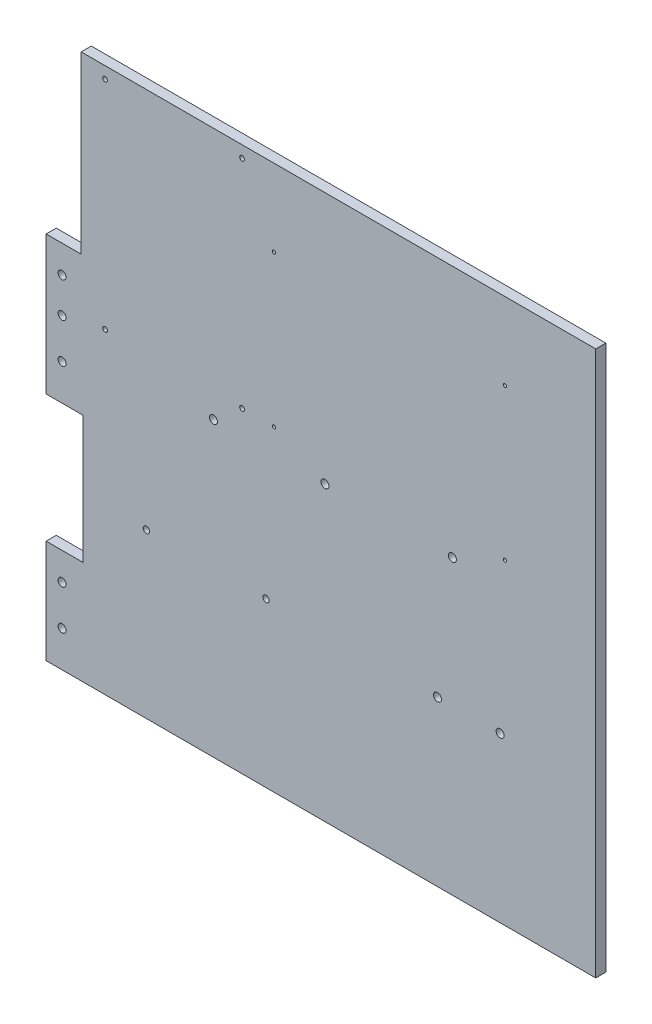
ISO-10303-21;
HEADER;
FILE_DESCRIPTION(('STEP AP214'),'2;1');
FILE_NAME('part.step','',(''),(''),'','','');
FILE_SCHEMA(('AUTOMOTIVE_DESIGN { 1 0 10303 214 1 1 1 1 }'));
ENDSEC;
DATA;
#1=APPLICATION_CONTEXT('core data for automotive mechanical design processes');
#2=APPLICATION_PROTOCOL_DEFINITION('international standard','automotive_design',2000,#1);
#3=PRODUCT_CONTEXT('',#1,'mechanical');
#4=PRODUCT('Part','Part','',(#3));
#5=PRODUCT_RELATED_PRODUCT_CATEGORY('part','',(#4));
#6=PRODUCT_DEFINITION_FORMATION('','',#4);
#7=PRODUCT_DEFINITION_CONTEXT('part definition',#1,'design');
#8=PRODUCT_DEFINITION('design','',#6,#7);
#9=PRODUCT_DEFINITION_SHAPE('','',#8);
#10=(LENGTH_UNIT() NAMED_UNIT(*) SI_UNIT(.MILLI.,.METRE.));
#11=(NAMED_UNIT(*) PLANE_ANGLE_UNIT() SI_UNIT($,.RADIAN.));
#12=(NAMED_UNIT(*) SI_UNIT($,.STERADIAN.) SOLID_ANGLE_UNIT());
#13=UNCERTAINTY_MEASURE_WITH_UNIT(LENGTH_MEASURE(1.E-05),#10,'distance_accuracy_value','');
#14=(GEOMETRIC_REPRESENTATION_CONTEXT(3) GLOBAL_UNCERTAINTY_ASSIGNED_CONTEXT((#13)) GLOBAL_UNIT_ASSIGNED_CONTEXT((#10,
#11,#12)) REPRESENTATION_CONTEXT('',''));
#15=CARTESIAN_POINT('',(0.,0.,0.));
#16=DIRECTION('',(0.,0.,1.));
#17=DIRECTION('',(1.,0.,0.));
#18=AXIS2_PLACEMENT_3D('',#15,#16,#17);
#19=CARTESIAN_POINT('',(731.320358487498,258.065863270593,-6.35));
#20=DIRECTION('',(1.,0.,0.));
#21=DIRECTION('',(0.,0.,-1.));
#22=AXIS2_PLACEMENT_3D('',#19,#20,#21);
#23=PLANE('',#22);
#24=DIRECTION('',(0.,1.,0.));
#25=VECTOR('',#24,1.);
#26=CARTESIAN_POINT('',(731.320358487498,258.065863270593,0.));
#27=LINE('',#26,#25);
#28=CARTESIAN_POINT('',(731.320358487498,258.065863270593,0.));
#29=VERTEX_POINT('',#28);
#30=CARTESIAN_POINT('',(731.320358487498,600.065863270593,0.));
#31=VERTEX_POINT('',#30);
#32=EDGE_CURVE('E146',#29,#31,#27,.T.);
#33=ORIENTED_EDGE('',*,*,#32,.F.);
#34=DIRECTION('',(0.,0.,1.));
#35=VECTOR('',#34,1.);
#36=CARTESIAN_POINT('',(731.320358487498,258.065863270593,-6.35));
#37=LINE('',#36,#35);
#38=CARTESIAN_POINT('',(731.320358487498,258.065863270593,-6.35));
#39=VERTEX_POINT('',#38);
#40=EDGE_CURVE('E11',#39,#29,#37,.T.);
#41=ORIENTED_EDGE('',*,*,#40,.F.);
#42=DIRECTION('',(0.,1.,0.));
#43=VECTOR('',#42,1.);
#44=CARTESIAN_POINT('',(731.320358487498,258.065863270593,-6.35));
#45=LINE('',#44,#43);
#46=CARTESIAN_POINT('',(731.320358487498,600.065863270593,-6.35));
#47=VERTEX_POINT('',#46);
#48=EDGE_CURVE('E173',#39,#47,#45,.T.);
#49=ORIENTED_EDGE('',*,*,#48,.T.);
#50=DIRECTION('',(0.,0.,1.));
#51=VECTOR('',#50,1.);
#52=CARTESIAN_POINT('',(731.320358487498,600.065863270593,-6.35));
#53=LINE('',#52,#51);
#54=EDGE_CURVE('E40',#47,#31,#53,.T.);
#55=ORIENTED_EDGE('',*,*,#54,.T.);
#56=EDGE_LOOP('',(#33,#41,#49,#55));
#57=FACE_BOUND('',#56,.T.);
#58=ADVANCED_FACE('F37',(#57),#23,.T.);
#59=CARTESIAN_POINT('',(731.320358487498,258.065863270593,-6.35));
#60=DIRECTION('',(0.,-1.,0.));
#61=DIRECTION('',(0.,0.,-1.));
#62=AXIS2_PLACEMENT_3D('',#59,#60,#61);
#63=PLANE('',#62);
#64=DIRECTION('',(1.,0.,0.));
#65=VECTOR('',#64,1.);
#66=CARTESIAN_POINT('',(731.320358487498,258.065863270593,0.));
#67=LINE('',#66,#65);
#68=CARTESIAN_POINT('',(386.320358487498,258.065863270593,0.));
#69=VERTEX_POINT('',#68);
#70=EDGE_CURVE('E171',#69,#29,#67,.T.);
#71=ORIENTED_EDGE('',*,*,#70,.F.);
#72=DIRECTION('',(0.,0.,1.));
#73=VECTOR('',#72,1.);
#74=CARTESIAN_POINT('',(386.320358487498,258.065863270593,-6.35));
#75=LINE('',#74,#73);
#76=CARTESIAN_POINT('',(386.320358487498,258.065863270593,-6.35));
#77=VERTEX_POINT('',#76);
#78=EDGE_CURVE('E46',#77,#69,#75,.T.);
#79=ORIENTED_EDGE('',*,*,#78,.F.);
#80=DIRECTION('',(1.,0.,0.));
#81=VECTOR('',#80,1.);
#82=CARTESIAN_POINT('',(731.320358487498,258.065863270593,-6.35));
#83=LINE('',#82,#81);
#84=EDGE_CURVE('E136',#77,#39,#83,.T.);
#85=ORIENTED_EDGE('',*,*,#84,.T.);
#86=ORIENTED_EDGE('',*,*,#40,.T.);
#87=EDGE_LOOP('',(#71,#79,#85,#86));
#88=FACE_BOUND('',#87,.T.);
#89=ADVANCED_FACE('F189',(#88),#63,.T.);
#90=CARTESIAN_POINT('',(386.320358487498,258.065863270593,-6.35));
#91=DIRECTION('',(-1.,0.,0.));
#92=DIRECTION('',(0.,0.,1.));
#93=AXIS2_PLACEMENT_3D('',#90,#91,#92);
#94=PLANE('',#93);
#95=DIRECTION('',(0.,-1.,0.));
#96=VECTOR('',#95,1.);
#97=CARTESIAN_POINT('',(386.320358487498,258.065863270593,0.));
#98=LINE('',#97,#96);
#99=CARTESIAN_POINT('',(386.320358487498,323.065863270593,0.));
#100=VERTEX_POINT('',#99);
#101=EDGE_CURVE('E123',#100,#69,#98,.T.);
#102=ORIENTED_EDGE('',*,*,#101,.F.);
#103=DIRECTION('',(0.,0.,1.));
#104=VECTOR('',#103,1.);
#105=CARTESIAN_POINT('',(386.320358487498,323.065863270593,-6.35));
#106=LINE('',#105,#104);
#107=CARTESIAN_POINT('',(386.320358487498,323.065863270593,-6.35));
#108=VERTEX_POINT('',#107);
#109=EDGE_CURVE('E118',#108,#100,#106,.T.);
#110=ORIENTED_EDGE('',*,*,#109,.F.);
#111=DIRECTION('',(0.,-1.,0.));
#112=VECTOR('',#111,1.);
#113=CARTESIAN_POINT('',(386.320358487498,258.065863270593,-6.35));
#114=LINE('',#113,#112);
#115=EDGE_CURVE('E121',#108,#77,#114,.T.);
#116=ORIENTED_EDGE('',*,*,#115,.T.);
#117=ORIENTED_EDGE('',*,*,#78,.T.);
#118=EDGE_LOOP('',(#102,#110,#116,#117));
#119=FACE_BOUND('',#118,.T.);
#120=ADVANCED_FACE('F120',(#119),#94,.T.);
#121=CARTESIAN_POINT('',(386.320358487498,323.065863270593,-6.35));
#122=DIRECTION('',(0.,1.,0.));
#123=DIRECTION('',(0.,0.,1.));
#124=AXIS2_PLACEMENT_3D('',#121,#122,#123);
#125=PLANE('',#124);
#126=DIRECTION('',(-1.,0.,0.));
#127=VECTOR('',#126,1.);
#128=CARTESIAN_POINT('',(386.320358487498,323.065863270593,0.));
#129=LINE('',#128,#127);
#130=CARTESIAN_POINT('',(409.320358487498,323.065863270593,0.));
#131=VERTEX_POINT('',#130);
#132=EDGE_CURVE('E168',#131,#100,#129,.T.);
#133=ORIENTED_EDGE('',*,*,#132,.F.);
#134=DIRECTION('',(0.,0.,1.));
#135=VECTOR('',#134,1.);
#136=CARTESIAN_POINT('',(409.320358487498,323.065863270593,-6.35));
#137=LINE('',#136,#135);
#138=CARTESIAN_POINT('',(409.320358487498,323.065863270593,-6.35));
#139=VERTEX_POINT('',#138);
#140=EDGE_CURVE('E128',#139,#131,#137,.T.);
#141=ORIENTED_EDGE('',*,*,#140,.F.);
#142=DIRECTION('',(-1.,0.,0.));
#143=VECTOR('',#142,1.);
#144=CARTESIAN_POINT('',(386.320358487498,323.065863270593,-6.35));
#145=LINE('',#144,#143);
#146=EDGE_CURVE('E134',#139,#108,#145,.T.);
#147=ORIENTED_EDGE('',*,*,#146,.T.);
#148=ORIENTED_EDGE('',*,*,#109,.T.);
#149=EDGE_LOOP('',(#133,#141,#147,#148));
#150=FACE_BOUND('',#149,.T.);
#151=ADVANCED_FACE('F138',(#150),#125,.T.);
#152=CARTESIAN_POINT('',(409.320358487498,403.065863270593,-6.35));
#153=DIRECTION('',(-1.,0.,0.));
#154=DIRECTION('',(0.,0.,1.));
#155=AXIS2_PLACEMENT_3D('',#152,#153,#154);
#156=PLANE('',#155);
#157=DIRECTION('',(0.,-1.,0.));
#158=VECTOR('',#157,1.);
#159=CARTESIAN_POINT('',(409.320358487498,403.065863270593,0.));
#160=LINE('',#159,#158);
#161=CARTESIAN_POINT('',(409.320358487498,403.065863270593,0.));
#162=VERTEX_POINT('',#161);
#163=EDGE_CURVE('E165',#162,#131,#160,.T.);
#164=ORIENTED_EDGE('',*,*,#163,.F.);
#165=DIRECTION('',(0.,0.,1.));
#166=VECTOR('',#165,1.);
#167=CARTESIAN_POINT('',(409.320358487498,403.065863270593,-6.35));
#168=LINE('',#167,#166);
#169=CARTESIAN_POINT('',(409.320358487498,403.065863270593,-6.35));
#170=VERTEX_POINT('',#169);
#171=EDGE_CURVE('E177',#170,#162,#168,.T.);
#172=ORIENTED_EDGE('',*,*,#171,.F.);
#173=DIRECTION('',(0.,-1.,0.));
#174=VECTOR('',#173,1.);
#175=CARTESIAN_POINT('',(409.320358487498,403.065863270593,-6.35));
#176=LINE('',#175,#174);
#177=EDGE_CURVE('E139',#170,#139,#176,.T.);
#178=ORIENTED_EDGE('',*,*,#177,.T.);
#179=ORIENTED_EDGE('',*,*,#140,.T.);
#180=EDGE_LOOP('',(#164,#172,#178,#179));
#181=FACE_BOUND('',#180,.T.);
#182=ADVANCED_FACE('F202',(#181),#156,.T.);
#183=CARTESIAN_POINT('',(409.320358487498,403.065863270593,-6.35));
#184=DIRECTION('',(0.,-1.,0.));
#185=DIRECTION('',(0.,0.,-1.));
#186=AXIS2_PLACEMENT_3D('',#183,#184,#185);
#187=PLANE('',#186);
#188=DIRECTION('',(1.,0.,0.));
#189=VECTOR('',#188,1.);
#190=CARTESIAN_POINT('',(409.320358487498,403.065863270593,0.));
#191=LINE('',#190,#189);
#192=CARTESIAN_POINT('',(386.320358487498,403.065863270593,0.));
#193=VERTEX_POINT('',#192);
#194=EDGE_CURVE('E162',#193,#162,#191,.T.);
#195=ORIENTED_EDGE('',*,*,#194,.F.);
#196=DIRECTION('',(0.,0.,1.));
#197=VECTOR('',#196,1.);
#198=CARTESIAN_POINT('',(386.320358487498,403.065863270593,-6.35));
#199=LINE('',#198,#197);
#200=CARTESIAN_POINT('',(386.320358487498,403.065863270593,-6.35));
#201=VERTEX_POINT('',#200);
#202=EDGE_CURVE('E179',#201,#193,#199,.T.);
#203=ORIENTED_EDGE('',*,*,#202,.F.);
#204=DIRECTION('',(1.,0.,0.));
#205=VECTOR('',#204,1.);
#206=CARTESIAN_POINT('',(409.320358487498,403.065863270593,-6.35));
#207=LINE('',#206,#205);
#208=EDGE_CURVE('E141',#201,#170,#207,.T.);
#209=ORIENTED_EDGE('',*,*,#208,.T.);
#210=ORIENTED_EDGE('',*,*,#171,.T.);
#211=EDGE_LOOP('',(#195,#203,#209,#210));
#212=FACE_BOUND('',#211,.T.);
#213=ADVANCED_FACE('F205',(#212),#187,.T.);
#214=CARTESIAN_POINT('',(386.320358487498,403.065863270593,-6.35));
#215=DIRECTION('',(-1.,0.,0.));
#216=DIRECTION('',(0.,0.,1.));
#217=AXIS2_PLACEMENT_3D('',#214,#215,#216);
#218=PLANE('',#217);
#219=DIRECTION('',(0.,-1.,0.));
#220=VECTOR('',#219,1.);
#221=CARTESIAN_POINT('',(386.320358487498,403.065863270593,0.));
#222=LINE('',#221,#220);
#223=CARTESIAN_POINT('',(386.320358487498,490.065863270593,0.));
#224=VERTEX_POINT('',#223);
#225=EDGE_CURVE('E159',#224,#193,#222,.T.);
#226=ORIENTED_EDGE('',*,*,#225,.F.);
#227=DIRECTION('',(0.,0.,1.));
#228=VECTOR('',#227,1.);
#229=CARTESIAN_POINT('',(386.320358487498,490.065863270593,-6.35));
#230=LINE('',#229,#228);
#231=CARTESIAN_POINT('',(386.320358487498,490.065863270593,-6.35));
#232=VERTEX_POINT('',#231);
#233=EDGE_CURVE('E181',#232,#224,#230,.T.);
#234=ORIENTED_EDGE('',*,*,#233,.F.);
#235=DIRECTION('',(0.,-1.,0.));
#236=VECTOR('',#235,1.);
#237=CARTESIAN_POINT('',(386.320358487498,403.065863270593,-6.35));
#238=LINE('',#237,#236);
#239=EDGE_CURVE('E445',#232,#201,#238,.T.);
#240=ORIENTED_EDGE('',*,*,#239,.T.);
#241=ORIENTED_EDGE('',*,*,#202,.T.);
#242=EDGE_LOOP('',(#226,#234,#240,#241));
#243=FACE_BOUND('',#242,.T.);
#244=ADVANCED_FACE('F209',(#243),#218,.T.);
#245=CARTESIAN_POINT('',(408.320358487498,490.065863270593,-6.35));
#246=DIRECTION('',(0.,1.,0.));
#247=DIRECTION('',(0.,0.,1.));
#248=AXIS2_PLACEMENT_3D('',#245,#246,#247);
#249=PLANE('',#248);
#250=DIRECTION('',(-1.,0.,0.));
#251=VECTOR('',#250,1.);
#252=CARTESIAN_POINT('',(408.320358487498,490.065863270593,0.));
#253=LINE('',#252,#251);
#254=CARTESIAN_POINT('',(408.320358487498,490.065863270593,0.));
#255=VERTEX_POINT('',#254);
#256=EDGE_CURVE('E156',#255,#224,#253,.T.);
#257=ORIENTED_EDGE('',*,*,#256,.F.);
#258=DIRECTION('',(0.,0.,1.));
#259=VECTOR('',#258,1.);
#260=CARTESIAN_POINT('',(408.320358487498,490.065863270593,-6.35));
#261=LINE('',#260,#259);
#262=CARTESIAN_POINT('',(408.320358487498,490.065863270593,-6.35));
#263=VERTEX_POINT('',#262);
#264=EDGE_CURVE('E183',#263,#255,#261,.T.);
#265=ORIENTED_EDGE('',*,*,#264,.F.);
#266=DIRECTION('',(-1.,0.,0.));
#267=VECTOR('',#266,1.);
#268=CARTESIAN_POINT('',(408.320358487498,490.065863270593,-6.35));
#269=LINE('',#268,#267);
#270=EDGE_CURVE('E442',#263,#232,#269,.T.);
#271=ORIENTED_EDGE('',*,*,#270,.T.);
#272=ORIENTED_EDGE('',*,*,#233,.T.);
#273=EDGE_LOOP('',(#257,#265,#271,#272));
#274=FACE_BOUND('',#273,.T.);
#275=ADVANCED_FACE('F213',(#274),#249,.T.);
#276=CARTESIAN_POINT('',(408.320358487498,600.065863270593,-6.35));
#277=DIRECTION('',(-1.,0.,0.));
#278=DIRECTION('',(0.,0.,1.));
#279=AXIS2_PLACEMENT_3D('',#276,#277,#278);
#280=PLANE('',#279);
#281=DIRECTION('',(0.,-1.,0.));
#282=VECTOR('',#281,1.);
#283=CARTESIAN_POINT('',(408.320358487498,600.065863270593,0.));
#284=LINE('',#283,#282);
#285=CARTESIAN_POINT('',(408.320358487498,600.065863270593,0.));
#286=VERTEX_POINT('',#285);
#287=EDGE_CURVE('E153',#286,#255,#284,.T.);
#288=ORIENTED_EDGE('',*,*,#287,.F.);
#289=DIRECTION('',(0.,0.,1.));
#290=VECTOR('',#289,1.);
#291=CARTESIAN_POINT('',(408.320358487498,600.065863270593,-6.35));
#292=LINE('',#291,#290);
#293=CARTESIAN_POINT('',(408.320358487498,600.065863270593,-6.35));
#294=VERTEX_POINT('',#293);
#295=EDGE_CURVE('E184',#294,#286,#292,.T.);
#296=ORIENTED_EDGE('',*,*,#295,.F.);
#297=DIRECTION('',(0.,-1.,0.));
#298=VECTOR('',#297,1.);
#299=CARTESIAN_POINT('',(408.320358487498,600.065863270593,-6.35));
#300=LINE('',#299,#298);
#301=EDGE_CURVE('E439',#294,#263,#300,.T.);
#302=ORIENTED_EDGE('',*,*,#301,.T.);
#303=ORIENTED_EDGE('',*,*,#264,.T.);
#304=EDGE_LOOP('',(#288,#296,#302,#303));
#305=FACE_BOUND('',#304,.T.);
#306=ADVANCED_FACE('F217',(#305),#280,.T.);
#307=CARTESIAN_POINT('',(731.320358487498,600.065863270593,-6.35));
#308=DIRECTION('',(0.,1.,0.));
#309=DIRECTION('',(0.,0.,1.));
#310=AXIS2_PLACEMENT_3D('',#307,#308,#309);
#311=PLANE('',#310);
#312=DIRECTION('',(-1.,0.,0.));
#313=VECTOR('',#312,1.);
#314=CARTESIAN_POINT('',(731.320358487498,600.065863270593,0.));
#315=LINE('',#314,#313);
#316=EDGE_CURVE('E149',#31,#286,#315,.T.);
#317=ORIENTED_EDGE('',*,*,#316,.F.);
#318=ORIENTED_EDGE('',*,*,#54,.F.);
#319=DIRECTION('',(-1.,0.,0.));
#320=VECTOR('',#319,1.);
#321=CARTESIAN_POINT('',(731.320358487498,600.065863270593,-6.35));
#322=LINE('',#321,#320);
#323=EDGE_CURVE('E437',#47,#294,#322,.T.);
#324=ORIENTED_EDGE('',*,*,#323,.T.);
#325=ORIENTED_EDGE('',*,*,#295,.T.);
#326=EDGE_LOOP('',(#317,#318,#324,#325));
#327=FACE_BOUND('',#326,.T.);
#328=ADVANCED_FACE('F186',(#327),#311,.T.);
#329=CARTESIAN_POINT('',(0.,0.,-6.35));
#330=DIRECTION('',(0.,0.,1.));
#331=DIRECTION('',(1.,0.,0.));
#332=AXIS2_PLACEMENT_3D('',#329,#330,#331);
#333=PLANE('',#332);
#334=CARTESIAN_POINT('',(671.320358487498,361.072616848398,-6.35));
#335=DIRECTION('',(0.,0.,1.));
#336=DIRECTION('',(1.,0.,0.));
#337=AXIS2_PLACEMENT_3D('',#334,#335,#336);
#338=CIRCLE('',#337,2.49999999999995);
#339=CARTESIAN_POINT('',(673.820358487498,361.072616848398,-6.35));
#340=VERTEX_POINT('',#339);
#341=EDGE_CURVE('E316',#340,#340,#338,.T.);
#342=ORIENTED_EDGE('',*,*,#341,.T.);
#343=EDGE_LOOP('',(#342));
#344=FACE_BOUND('',#343,.T.);
#345=CARTESIAN_POINT('',(631.970358487498,361.072616848398,-6.35));
#346=DIRECTION('',(0.,0.,1.));
#347=DIRECTION('',(1.,0.,0.));
#348=AXIS2_PLACEMENT_3D('',#345,#346,#347);
#349=CIRCLE('',#348,2.49999999999995);
#350=CARTESIAN_POINT('',(634.470358487498,361.072616848398,-6.35));
#351=VERTEX_POINT('',#350);
#352=EDGE_CURVE('E324',#351,#351,#349,.T.);
#353=ORIENTED_EDGE('',*,*,#352,.T.);
#354=EDGE_LOOP('',(#353));
#355=FACE_BOUND('',#354,.T.);
#356=CARTESIAN_POINT('',(674.320358487498,456.687351768091,-6.35));
#357=DIRECTION('',(0.,0.,1.));
#358=DIRECTION('',(1.,0.,0.));
#359=AXIS2_PLACEMENT_3D('',#356,#357,#358);
#360=CIRCLE('',#359,1.05);
#361=CARTESIAN_POINT('',(675.370358487498,456.687351768091,-6.35));
#362=VERTEX_POINT('',#361);
#363=EDGE_CURVE('E330',#362,#362,#360,.T.);
#364=ORIENTED_EDGE('',*,*,#363,.T.);
#365=EDGE_LOOP('',(#364));
#366=FACE_BOUND('',#365,.T.);
#367=CARTESIAN_POINT('',(529.320358487498,456.687351768091,-6.35));
#368=DIRECTION('',(0.,0.,1.));
#369=DIRECTION('',(1.,0.,0.));
#370=AXIS2_PLACEMENT_3D('',#367,#368,#369);
#371=CIRCLE('',#370,1.05);
#372=CARTESIAN_POINT('',(530.370358487498,456.687351768091,-6.35));
#373=VERTEX_POINT('',#372);
#374=EDGE_CURVE('E336',#373,#373,#371,.T.);
#375=ORIENTED_EDGE('',*,*,#374,.T.);
#376=EDGE_LOOP('',(#375));
#377=FACE_BOUND('',#376,.T.);
#378=CARTESIAN_POINT('',(674.320358487498,551.687351768091,-6.35));
#379=DIRECTION('',(0.,0.,1.));
#380=DIRECTION('',(1.,0.,0.));
#381=AXIS2_PLACEMENT_3D('',#378,#379,#380);
#382=CIRCLE('',#381,1.04999999999988);
#383=CARTESIAN_POINT('',(675.370358487498,551.687351768091,-6.35));
#384=VERTEX_POINT('',#383);
#385=EDGE_CURVE('E342',#384,#384,#382,.T.);
#386=ORIENTED_EDGE('',*,*,#385,.T.);
#387=EDGE_LOOP('',(#386));
#388=FACE_BOUND('',#387,.T.);
#389=CARTESIAN_POINT('',(529.320358487498,551.687351768091,-6.35));
#390=DIRECTION('',(0.,0.,1.));
#391=DIRECTION('',(1.,0.,0.));
#392=AXIS2_PLACEMENT_3D('',#389,#390,#391);
#393=CIRCLE('',#392,1.04999999999988);
#394=CARTESIAN_POINT('',(530.370358487498,551.687351768091,-6.35));
#395=VERTEX_POINT('',#394);
#396=EDGE_CURVE('E348',#395,#395,#393,.T.);
#397=ORIENTED_EDGE('',*,*,#396,.T.);
#398=EDGE_LOOP('',(#397));
#399=FACE_BOUND('',#398,.T.);
#400=CARTESIAN_POINT('',(423.320358487498,456.687351768091,-6.35));
#401=DIRECTION('',(0.,0.,1.));
#402=DIRECTION('',(1.,0.,0.));
#403=AXIS2_PLACEMENT_3D('',#400,#401,#402);
#404=CIRCLE('',#403,1.5);
#405=CARTESIAN_POINT('',(424.820358487498,456.687351768091,-6.35));
#406=VERTEX_POINT('',#405);
#407=EDGE_CURVE('E354',#406,#406,#404,.T.);
#408=ORIENTED_EDGE('',*,*,#407,.T.);
#409=EDGE_LOOP('',(#408));
#410=FACE_BOUND('',#409,.T.);
#411=CARTESIAN_POINT('',(509.320358487498,456.687351768091,-6.35));
#412=DIRECTION('',(0.,0.,1.));
#413=DIRECTION('',(1.,0.,0.));
#414=AXIS2_PLACEMENT_3D('',#411,#412,#413);
#415=CIRCLE('',#414,1.49999999999995);
#416=CARTESIAN_POINT('',(510.820358487498,456.687351768091,-6.35));
#417=VERTEX_POINT('',#416);
#418=EDGE_CURVE('E360',#417,#417,#415,.T.);
#419=ORIENTED_EDGE('',*,*,#418,.T.);
#420=EDGE_LOOP('',(#419));
#421=FACE_BOUND('',#420,.T.);
#422=CARTESIAN_POINT('',(509.320358487498,592.687351768091,-6.35));
#423=DIRECTION('',(0.,0.,1.));
#424=DIRECTION('',(1.,0.,0.));
#425=AXIS2_PLACEMENT_3D('',#422,#423,#424);
#426=CIRCLE('',#425,1.49999999999995);
#427=CARTESIAN_POINT('',(510.820358487498,592.687351768091,-6.35));
#428=VERTEX_POINT('',#427);
#429=EDGE_CURVE('E366',#428,#428,#426,.T.);
#430=ORIENTED_EDGE('',*,*,#429,.T.);
#431=EDGE_LOOP('',(#430));
#432=FACE_BOUND('',#431,.T.);
#433=CARTESIAN_POINT('',(423.320358487498,592.687351768091,-6.35));
#434=DIRECTION('',(0.,0.,1.));
#435=DIRECTION('',(1.,0.,0.));
#436=AXIS2_PLACEMENT_3D('',#433,#434,#435);
#437=CIRCLE('',#436,1.5);
#438=CARTESIAN_POINT('',(424.820358487498,592.687351768091,-6.35));
#439=VERTEX_POINT('',#438);
#440=EDGE_CURVE('E372',#439,#439,#437,.T.);
#441=ORIENTED_EDGE('',*,*,#440,.T.);
#442=EDGE_LOOP('',(#441));
#443=FACE_BOUND('',#442,.T.);
#444=CARTESIAN_POINT('',(524.320358487498,360.687351768091,-6.35));
#445=DIRECTION('',(0.,0.,1.));
#446=DIRECTION('',(1.,0.,0.));
#447=AXIS2_PLACEMENT_3D('',#444,#445,#446);
#448=CIRCLE('',#447,1.99999999999989);
#449=CARTESIAN_POINT('',(526.320358487498,360.687351768091,-6.35));
#450=VERTEX_POINT('',#449);
#451=EDGE_CURVE('E378',#450,#450,#448,.T.);
#452=ORIENTED_EDGE('',*,*,#451,.T.);
#453=EDGE_LOOP('',(#452));
#454=FACE_BOUND('',#453,.T.);
#455=CARTESIAN_POINT('',(449.269021810185,360.687351768091,-6.35));
#456=DIRECTION('',(0.,0.,1.));
#457=DIRECTION('',(1.,0.,0.));
#458=AXIS2_PLACEMENT_3D('',#455,#456,#457);
#459=CIRCLE('',#458,2.);
#460=CARTESIAN_POINT('',(451.269021810185,360.687351768091,-6.35));
#461=VERTEX_POINT('',#460);
#462=EDGE_CURVE('E384',#461,#461,#459,.T.);
#463=ORIENTED_EDGE('',*,*,#462,.T.);
#464=EDGE_LOOP('',(#463));
#465=FACE_BOUND('',#464,.T.);
#466=CARTESIAN_POINT('',(641.320358487498,441.687351768091,-6.35));
#467=DIRECTION('',(0.,0.,1.));
#468=DIRECTION('',(1.,0.,0.));
#469=AXIS2_PLACEMENT_3D('',#466,#467,#468);
#470=CIRCLE('',#469,2.49999999999995);
#471=CARTESIAN_POINT('',(643.820358487498,441.687351768091,-6.35));
#472=VERTEX_POINT('',#471);
#473=EDGE_CURVE('E390',#472,#472,#470,.T.);
#474=ORIENTED_EDGE('',*,*,#473,.T.);
#475=EDGE_LOOP('',(#474));
#476=FACE_BOUND('',#475,.T.);
#477=CARTESIAN_POINT('',(561.320358487498,441.687351768091,-6.35));
#478=DIRECTION('',(0.,0.,1.));
#479=DIRECTION('',(1.,0.,0.));
#480=AXIS2_PLACEMENT_3D('',#477,#478,#479);
#481=CIRCLE('',#480,2.49999999999984);
#482=CARTESIAN_POINT('',(563.820358487498,441.687351768091,-6.35));
#483=VERTEX_POINT('',#482);
#484=EDGE_CURVE('E396',#483,#483,#481,.T.);
#485=ORIENTED_EDGE('',*,*,#484,.T.);
#486=EDGE_LOOP('',(#485));
#487=FACE_BOUND('',#486,.T.);
#488=CARTESIAN_POINT('',(491.320358487498,441.687351768091,-6.35));
#489=DIRECTION('',(0.,0.,1.));
#490=DIRECTION('',(1.,0.,0.));
#491=AXIS2_PLACEMENT_3D('',#488,#489,#490);
#492=CIRCLE('',#491,2.5);
#493=CARTESIAN_POINT('',(493.820358487498,441.687351768091,-6.35));
#494=VERTEX_POINT('',#493);
#495=EDGE_CURVE('E402',#494,#494,#492,.T.);
#496=ORIENTED_EDGE('',*,*,#495,.T.);
#497=EDGE_LOOP('',(#496));
#498=FACE_BOUND('',#497,.T.);
#499=CARTESIAN_POINT('',(396.320358487498,280.687351768091,-6.35));
#500=DIRECTION('',(0.,0.,1.));
#501=DIRECTION('',(1.,0.,0.));
#502=AXIS2_PLACEMENT_3D('',#499,#500,#501);
#503=CIRCLE('',#502,2.5);
#504=CARTESIAN_POINT('',(398.820358487498,280.687351768091,-6.35));
#505=VERTEX_POINT('',#504);
#506=EDGE_CURVE('E408',#505,#505,#503,.T.);
#507=ORIENTED_EDGE('',*,*,#506,.T.);
#508=EDGE_LOOP('',(#507));
#509=FACE_BOUND('',#508,.T.);
#510=CARTESIAN_POINT('',(396.320358487498,305.687351768091,-6.35));
#511=DIRECTION('',(0.,0.,1.));
#512=DIRECTION('',(1.,0.,0.));
#513=AXIS2_PLACEMENT_3D('',#510,#511,#512);
#514=CIRCLE('',#513,2.5);
#515=CARTESIAN_POINT('',(398.820358487498,305.687351768091,-6.35));
#516=VERTEX_POINT('',#515);
#517=EDGE_CURVE('E414',#516,#516,#514,.T.);
#518=ORIENTED_EDGE('',*,*,#517,.T.);
#519=EDGE_LOOP('',(#518));
#520=FACE_BOUND('',#519,.T.);
#521=CARTESIAN_POINT('',(396.320358487498,425.687351768091,-6.35));
#522=DIRECTION('',(0.,0.,1.));
#523=DIRECTION('',(1.,0.,0.));
#524=AXIS2_PLACEMENT_3D('',#521,#522,#523);
#525=CIRCLE('',#524,2.5);
#526=CARTESIAN_POINT('',(398.820358487498,425.687351768091,-6.35));
#527=VERTEX_POINT('',#526);
#528=EDGE_CURVE('E420',#527,#527,#525,.T.);
#529=ORIENTED_EDGE('',*,*,#528,.T.);
#530=EDGE_LOOP('',(#529));
#531=FACE_BOUND('',#530,.T.);
#532=CARTESIAN_POINT('',(396.320358487498,450.687351768091,-6.35));
#533=DIRECTION('',(0.,0.,1.));
#534=DIRECTION('',(1.,0.,0.));
#535=AXIS2_PLACEMENT_3D('',#532,#533,#534);
#536=CIRCLE('',#535,2.5);
#537=CARTESIAN_POINT('',(398.820358487498,450.687351768091,-6.35));
#538=VERTEX_POINT('',#537);
#539=EDGE_CURVE('E426',#538,#538,#536,.T.);
#540=ORIENTED_EDGE('',*,*,#539,.T.);
#541=EDGE_LOOP('',(#540));
#542=FACE_BOUND('',#541,.T.);
#543=CARTESIAN_POINT('',(396.320358487498,472.687351768091,-6.35));
#544=DIRECTION('',(0.,0.,1.));
#545=DIRECTION('',(1.,0.,0.));
#546=AXIS2_PLACEMENT_3D('',#543,#544,#545);
#547=CIRCLE('',#546,2.5);
#548=CARTESIAN_POINT('',(398.820358487498,472.687351768091,-6.35));
#549=VERTEX_POINT('',#548);
#550=EDGE_CURVE('E150',#549,#549,#547,.T.);
#551=ORIENTED_EDGE('',*,*,#550,.T.);
#552=EDGE_LOOP('',(#551));
#553=FACE_BOUND('',#552,.T.);
#554=ORIENTED_EDGE('',*,*,#48,.F.);
#555=ORIENTED_EDGE('',*,*,#84,.F.);
#556=ORIENTED_EDGE('',*,*,#115,.F.);
#557=ORIENTED_EDGE('',*,*,#146,.F.);
#558=ORIENTED_EDGE('',*,*,#177,.F.);
#559=ORIENTED_EDGE('',*,*,#208,.F.);
#560=ORIENTED_EDGE('',*,*,#239,.F.);
#561=ORIENTED_EDGE('',*,*,#270,.F.);
#562=ORIENTED_EDGE('',*,*,#301,.F.);
#563=ORIENTED_EDGE('',*,*,#323,.F.);
#564=EDGE_LOOP('',(#554,#555,#556,#557,#558,#559,#560,#561,#562,#563));
#565=FACE_BOUND('',#564,.T.);
#566=ADVANCED_FACE('F132',(#344,#355,#366,#377,#388,#399,#410,#421,#432,#443,#454,#465,#476,
#487,#498,#509,#520,#531,#542,#553,#565),#333,.F.);
#567=CARTESIAN_POINT('',(0.,0.,0.));
#568=DIRECTION('',(0.,0.,1.));
#569=DIRECTION('',(1.,0.,0.));
#570=AXIS2_PLACEMENT_3D('',#567,#568,#569);
#571=PLANE('',#570);
#572=CARTESIAN_POINT('',(671.320358487498,361.072616848398,0.));
#573=DIRECTION('',(0.,0.,1.));
#574=DIRECTION('',(1.,0.,0.));
#575=AXIS2_PLACEMENT_3D('',#572,#573,#574);
#576=CIRCLE('',#575,2.49999999999995);
#577=CARTESIAN_POINT('',(673.820358487498,361.072616848398,0.));
#578=VERTEX_POINT('',#577);
#579=EDGE_CURVE('E319',#578,#578,#576,.T.);
#580=ORIENTED_EDGE('',*,*,#579,.F.);
#581=EDGE_LOOP('',(#580));
#582=FACE_BOUND('',#581,.T.);
#583=CARTESIAN_POINT('',(631.970358487498,361.072616848398,0.));
#584=DIRECTION('',(0.,0.,1.));
#585=DIRECTION('',(1.,0.,0.));
#586=AXIS2_PLACEMENT_3D('',#583,#584,#585);
#587=CIRCLE('',#586,2.49999999999995);
#588=CARTESIAN_POINT('',(634.470358487498,361.072616848398,0.));
#589=VERTEX_POINT('',#588);
#590=EDGE_CURVE('E321',#589,#589,#587,.T.);
#591=ORIENTED_EDGE('',*,*,#590,.F.);
#592=EDGE_LOOP('',(#591));
#593=FACE_BOUND('',#592,.T.);
#594=CARTESIAN_POINT('',(674.320358487498,456.687351768091,0.));
#595=DIRECTION('',(0.,0.,1.));
#596=DIRECTION('',(1.,0.,0.));
#597=AXIS2_PLACEMENT_3D('',#594,#595,#596);
#598=CIRCLE('',#597,1.05);
#599=CARTESIAN_POINT('',(675.370358487498,456.687351768091,0.));
#600=VERTEX_POINT('',#599);
#601=EDGE_CURVE('E327',#600,#600,#598,.T.);
#602=ORIENTED_EDGE('',*,*,#601,.F.);
#603=EDGE_LOOP('',(#602));
#604=FACE_BOUND('',#603,.T.);
#605=CARTESIAN_POINT('',(529.320358487498,456.687351768091,0.));
#606=DIRECTION('',(0.,0.,1.));
#607=DIRECTION('',(1.,0.,0.));
#608=AXIS2_PLACEMENT_3D('',#605,#606,#607);
#609=CIRCLE('',#608,1.05);
#610=CARTESIAN_POINT('',(530.370358487498,456.687351768091,0.));
#611=VERTEX_POINT('',#610);
#612=EDGE_CURVE('E333',#611,#611,#609,.T.);
#613=ORIENTED_EDGE('',*,*,#612,.F.);
#614=EDGE_LOOP('',(#613));
#615=FACE_BOUND('',#614,.T.);
#616=CARTESIAN_POINT('',(674.320358487498,551.687351768091,0.));
#617=DIRECTION('',(0.,0.,1.));
#618=DIRECTION('',(1.,0.,0.));
#619=AXIS2_PLACEMENT_3D('',#616,#617,#618);
#620=CIRCLE('',#619,1.04999999999988);
#621=CARTESIAN_POINT('',(675.370358487498,551.687351768091,0.));
#622=VERTEX_POINT('',#621);
#623=EDGE_CURVE('E339',#622,#622,#620,.T.);
#624=ORIENTED_EDGE('',*,*,#623,.F.);
#625=EDGE_LOOP('',(#624));
#626=FACE_BOUND('',#625,.T.);
#627=CARTESIAN_POINT('',(529.320358487498,551.687351768091,0.));
#628=DIRECTION('',(0.,0.,1.));
#629=DIRECTION('',(1.,0.,0.));
#630=AXIS2_PLACEMENT_3D('',#627,#628,#629);
#631=CIRCLE('',#630,1.04999999999988);
#632=CARTESIAN_POINT('',(530.370358487498,551.687351768091,0.));
#633=VERTEX_POINT('',#632);
#634=EDGE_CURVE('E345',#633,#633,#631,.T.);
#635=ORIENTED_EDGE('',*,*,#634,.F.);
#636=EDGE_LOOP('',(#635));
#637=FACE_BOUND('',#636,.T.);
#638=CARTESIAN_POINT('',(423.320358487498,456.687351768091,0.));
#639=DIRECTION('',(0.,0.,1.));
#640=DIRECTION('',(1.,0.,0.));
#641=AXIS2_PLACEMENT_3D('',#638,#639,#640);
#642=CIRCLE('',#641,1.5);
#643=CARTESIAN_POINT('',(424.820358487498,456.687351768091,0.));
#644=VERTEX_POINT('',#643);
#645=EDGE_CURVE('E351',#644,#644,#642,.T.);
#646=ORIENTED_EDGE('',*,*,#645,.F.);
#647=EDGE_LOOP('',(#646));
#648=FACE_BOUND('',#647,.T.);
#649=CARTESIAN_POINT('',(509.320358487498,456.687351768091,0.));
#650=DIRECTION('',(0.,0.,1.));
#651=DIRECTION('',(1.,0.,0.));
#652=AXIS2_PLACEMENT_3D('',#649,#650,#651);
#653=CIRCLE('',#652,1.49999999999995);
#654=CARTESIAN_POINT('',(510.820358487498,456.687351768091,0.));
#655=VERTEX_POINT('',#654);
#656=EDGE_CURVE('E357',#655,#655,#653,.T.);
#657=ORIENTED_EDGE('',*,*,#656,.F.);
#658=EDGE_LOOP('',(#657));
#659=FACE_BOUND('',#658,.T.);
#660=CARTESIAN_POINT('',(509.320358487498,592.687351768091,0.));
#661=DIRECTION('',(0.,0.,1.));
#662=DIRECTION('',(1.,0.,0.));
#663=AXIS2_PLACEMENT_3D('',#660,#661,#662);
#664=CIRCLE('',#663,1.49999999999995);
#665=CARTESIAN_POINT('',(510.820358487498,592.687351768091,0.));
#666=VERTEX_POINT('',#665);
#667=EDGE_CURVE('E363',#666,#666,#664,.T.);
#668=ORIENTED_EDGE('',*,*,#667,.F.);
#669=EDGE_LOOP('',(#668));
#670=FACE_BOUND('',#669,.T.);
#671=CARTESIAN_POINT('',(423.320358487498,592.687351768091,0.));
#672=DIRECTION('',(0.,0.,1.));
#673=DIRECTION('',(1.,0.,0.));
#674=AXIS2_PLACEMENT_3D('',#671,#672,#673);
#675=CIRCLE('',#674,1.5);
#676=CARTESIAN_POINT('',(424.820358487498,592.687351768091,0.));
#677=VERTEX_POINT('',#676);
#678=EDGE_CURVE('E369',#677,#677,#675,.T.);
#679=ORIENTED_EDGE('',*,*,#678,.F.);
#680=EDGE_LOOP('',(#679));
#681=FACE_BOUND('',#680,.T.);
#682=CARTESIAN_POINT('',(524.320358487498,360.687351768091,0.));
#683=DIRECTION('',(0.,0.,1.));
#684=DIRECTION('',(1.,0.,0.));
#685=AXIS2_PLACEMENT_3D('',#682,#683,#684);
#686=CIRCLE('',#685,1.99999999999989);
#687=CARTESIAN_POINT('',(526.320358487498,360.687351768091,0.));
#688=VERTEX_POINT('',#687);
#689=EDGE_CURVE('E375',#688,#688,#686,.T.);
#690=ORIENTED_EDGE('',*,*,#689,.F.);
#691=EDGE_LOOP('',(#690));
#692=FACE_BOUND('',#691,.T.);
#693=CARTESIAN_POINT('',(449.269021810185,360.687351768091,0.));
#694=DIRECTION('',(0.,0.,1.));
#695=DIRECTION('',(1.,0.,0.));
#696=AXIS2_PLACEMENT_3D('',#693,#694,#695);
#697=CIRCLE('',#696,2.);
#698=CARTESIAN_POINT('',(451.269021810185,360.687351768091,0.));
#699=VERTEX_POINT('',#698);
#700=EDGE_CURVE('E381',#699,#699,#697,.T.);
#701=ORIENTED_EDGE('',*,*,#700,.F.);
#702=EDGE_LOOP('',(#701));
#703=FACE_BOUND('',#702,.T.);
#704=CARTESIAN_POINT('',(641.320358487498,441.687351768091,0.));
#705=DIRECTION('',(0.,0.,1.));
#706=DIRECTION('',(1.,0.,0.));
#707=AXIS2_PLACEMENT_3D('',#704,#705,#706);
#708=CIRCLE('',#707,2.49999999999995);
#709=CARTESIAN_POINT('',(643.820358487498,441.687351768091,0.));
#710=VERTEX_POINT('',#709);
#711=EDGE_CURVE('E387',#710,#710,#708,.T.);
#712=ORIENTED_EDGE('',*,*,#711,.F.);
#713=EDGE_LOOP('',(#712));
#714=FACE_BOUND('',#713,.T.);
#715=CARTESIAN_POINT('',(561.320358487498,441.687351768091,0.));
#716=DIRECTION('',(0.,0.,1.));
#717=DIRECTION('',(1.,0.,0.));
#718=AXIS2_PLACEMENT_3D('',#715,#716,#717);
#719=CIRCLE('',#718,2.49999999999984);
#720=CARTESIAN_POINT('',(563.820358487498,441.687351768091,0.));
#721=VERTEX_POINT('',#720);
#722=EDGE_CURVE('E393',#721,#721,#719,.T.);
#723=ORIENTED_EDGE('',*,*,#722,.F.);
#724=EDGE_LOOP('',(#723));
#725=FACE_BOUND('',#724,.T.);
#726=CARTESIAN_POINT('',(491.320358487498,441.687351768091,0.));
#727=DIRECTION('',(0.,0.,1.));
#728=DIRECTION('',(1.,0.,0.));
#729=AXIS2_PLACEMENT_3D('',#726,#727,#728);
#730=CIRCLE('',#729,2.5);
#731=CARTESIAN_POINT('',(493.820358487498,441.687351768091,0.));
#732=VERTEX_POINT('',#731);
#733=EDGE_CURVE('E399',#732,#732,#730,.T.);
#734=ORIENTED_EDGE('',*,*,#733,.F.);
#735=EDGE_LOOP('',(#734));
#736=FACE_BOUND('',#735,.T.);
#737=CARTESIAN_POINT('',(396.320358487498,280.687351768091,0.));
#738=DIRECTION('',(0.,0.,1.));
#739=DIRECTION('',(1.,0.,0.));
#740=AXIS2_PLACEMENT_3D('',#737,#738,#739);
#741=CIRCLE('',#740,2.5);
#742=CARTESIAN_POINT('',(398.820358487498,280.687351768091,0.));
#743=VERTEX_POINT('',#742);
#744=EDGE_CURVE('E405',#743,#743,#741,.T.);
#745=ORIENTED_EDGE('',*,*,#744,.F.);
#746=EDGE_LOOP('',(#745));
#747=FACE_BOUND('',#746,.T.);
#748=CARTESIAN_POINT('',(396.320358487498,305.687351768091,0.));
#749=DIRECTION('',(0.,0.,1.));
#750=DIRECTION('',(1.,0.,0.));
#751=AXIS2_PLACEMENT_3D('',#748,#749,#750);
#752=CIRCLE('',#751,2.5);
#753=CARTESIAN_POINT('',(398.820358487498,305.687351768091,0.));
#754=VERTEX_POINT('',#753);
#755=EDGE_CURVE('E411',#754,#754,#752,.T.);
#756=ORIENTED_EDGE('',*,*,#755,.F.);
#757=EDGE_LOOP('',(#756));
#758=FACE_BOUND('',#757,.T.);
#759=CARTESIAN_POINT('',(396.320358487498,425.687351768091,0.));
#760=DIRECTION('',(0.,0.,1.));
#761=DIRECTION('',(1.,0.,0.));
#762=AXIS2_PLACEMENT_3D('',#759,#760,#761);
#763=CIRCLE('',#762,2.5);
#764=CARTESIAN_POINT('',(398.820358487498,425.687351768091,0.));
#765=VERTEX_POINT('',#764);
#766=EDGE_CURVE('E417',#765,#765,#763,.T.);
#767=ORIENTED_EDGE('',*,*,#766,.F.);
#768=EDGE_LOOP('',(#767));
#769=FACE_BOUND('',#768,.T.);
#770=CARTESIAN_POINT('',(396.320358487498,450.687351768091,0.));
#771=DIRECTION('',(0.,0.,1.));
#772=DIRECTION('',(1.,0.,0.));
#773=AXIS2_PLACEMENT_3D('',#770,#771,#772);
#774=CIRCLE('',#773,2.5);
#775=CARTESIAN_POINT('',(398.820358487498,450.687351768091,0.));
#776=VERTEX_POINT('',#775);
#777=EDGE_CURVE('E423',#776,#776,#774,.T.);
#778=ORIENTED_EDGE('',*,*,#777,.F.);
#779=EDGE_LOOP('',(#778));
#780=FACE_BOUND('',#779,.T.);
#781=CARTESIAN_POINT('',(396.320358487498,472.687351768091,0.));
#782=DIRECTION('',(0.,0.,1.));
#783=DIRECTION('',(1.,0.,0.));
#784=AXIS2_PLACEMENT_3D('',#781,#782,#783);
#785=CIRCLE('',#784,2.5);
#786=CARTESIAN_POINT('',(398.820358487498,472.687351768091,0.));
#787=VERTEX_POINT('',#786);
#788=EDGE_CURVE('E429',#787,#787,#785,.T.);
#789=ORIENTED_EDGE('',*,*,#788,.F.);
#790=EDGE_LOOP('',(#789));
#791=FACE_BOUND('',#790,.T.);
#792=ORIENTED_EDGE('',*,*,#32,.T.);
#793=ORIENTED_EDGE('',*,*,#316,.T.);
#794=ORIENTED_EDGE('',*,*,#287,.T.);
#795=ORIENTED_EDGE('',*,*,#256,.T.);
#796=ORIENTED_EDGE('',*,*,#225,.T.);
#797=ORIENTED_EDGE('',*,*,#194,.T.);
#798=ORIENTED_EDGE('',*,*,#163,.T.);
#799=ORIENTED_EDGE('',*,*,#132,.T.);
#800=ORIENTED_EDGE('',*,*,#101,.T.);
#801=ORIENTED_EDGE('',*,*,#70,.T.);
#802=EDGE_LOOP('',(#792,#793,#794,#795,#796,#797,#798,#799,#800,#801));
#803=FACE_BOUND('',#802,.T.);
#804=ADVANCED_FACE('F188',(#582,#593,#604,#615,#626,#637,#648,#659,#670,#681,#692,#703,#714,
#725,#736,#747,#758,#769,#780,#791,#803),#571,.T.);
#805=CARTESIAN_POINT('',(396.320358487498,472.687351768091,-6.35));
#806=DIRECTION('',(0.,0.,1.));
#807=DIRECTION('',(1.,0.,0.));
#808=AXIS2_PLACEMENT_3D('',#805,#806,#807);
#809=CYLINDRICAL_SURFACE('',#808,2.5);
#810=ORIENTED_EDGE('',*,*,#550,.F.);
#811=EDGE_LOOP('',(#810));
#812=FACE_BOUND('',#811,.T.);
#813=ORIENTED_EDGE('',*,*,#788,.T.);
#814=EDGE_LOOP('',(#813));
#815=FACE_BOUND('',#814,.T.);
#816=ADVANCED_FACE('F229',(#812,#815),#809,.F.);
#817=CARTESIAN_POINT('',(396.320358487498,450.687351768091,-6.35));
#818=DIRECTION('',(0.,0.,1.));
#819=DIRECTION('',(1.,0.,0.));
#820=AXIS2_PLACEMENT_3D('',#817,#818,#819);
#821=CYLINDRICAL_SURFACE('',#820,2.5);
#822=ORIENTED_EDGE('',*,*,#539,.F.);
#823=EDGE_LOOP('',(#822));
#824=FACE_BOUND('',#823,.T.);
#825=ORIENTED_EDGE('',*,*,#777,.T.);
#826=EDGE_LOOP('',(#825));
#827=FACE_BOUND('',#826,.T.);
#828=ADVANCED_FACE('F236',(#824,#827),#821,.F.);
#829=CARTESIAN_POINT('',(396.320358487498,425.687351768091,-6.35));
#830=DIRECTION('',(0.,0.,1.));
#831=DIRECTION('',(1.,0.,0.));
#832=AXIS2_PLACEMENT_3D('',#829,#830,#831);
#833=CYLINDRICAL_SURFACE('',#832,2.5);
#834=ORIENTED_EDGE('',*,*,#528,.F.);
#835=EDGE_LOOP('',(#834));
#836=FACE_BOUND('',#835,.T.);
#837=ORIENTED_EDGE('',*,*,#766,.T.);
#838=EDGE_LOOP('',(#837));
#839=FACE_BOUND('',#838,.T.);
#840=ADVANCED_FACE('F240',(#836,#839),#833,.F.);
#841=CARTESIAN_POINT('',(396.320358487498,305.687351768091,-6.35));
#842=DIRECTION('',(0.,0.,1.));
#843=DIRECTION('',(1.,0.,0.));
#844=AXIS2_PLACEMENT_3D('',#841,#842,#843);
#845=CYLINDRICAL_SURFACE('',#844,2.5);
#846=ORIENTED_EDGE('',*,*,#517,.F.);
#847=EDGE_LOOP('',(#846));
#848=FACE_BOUND('',#847,.T.);
#849=ORIENTED_EDGE('',*,*,#755,.T.);
#850=EDGE_LOOP('',(#849));
#851=FACE_BOUND('',#850,.T.);
#852=ADVANCED_FACE('F244',(#848,#851),#845,.F.);
#853=CARTESIAN_POINT('',(396.320358487498,280.687351768091,-6.35));
#854=DIRECTION('',(0.,0.,1.));
#855=DIRECTION('',(1.,0.,0.));
#856=AXIS2_PLACEMENT_3D('',#853,#854,#855);
#857=CYLINDRICAL_SURFACE('',#856,2.5);
#858=ORIENTED_EDGE('',*,*,#506,.F.);
#859=EDGE_LOOP('',(#858));
#860=FACE_BOUND('',#859,.T.);
#861=ORIENTED_EDGE('',*,*,#744,.T.);
#862=EDGE_LOOP('',(#861));
#863=FACE_BOUND('',#862,.T.);
#864=ADVANCED_FACE('F248',(#860,#863),#857,.F.);
#865=CARTESIAN_POINT('',(491.320358487498,441.687351768091,-6.35));
#866=DIRECTION('',(0.,0.,1.));
#867=DIRECTION('',(1.,0.,0.));
#868=AXIS2_PLACEMENT_3D('',#865,#866,#867);
#869=CYLINDRICAL_SURFACE('',#868,2.5);
#870=ORIENTED_EDGE('',*,*,#495,.F.);
#871=EDGE_LOOP('',(#870));
#872=FACE_BOUND('',#871,.T.);
#873=ORIENTED_EDGE('',*,*,#733,.T.);
#874=EDGE_LOOP('',(#873));
#875=FACE_BOUND('',#874,.T.);
#876=ADVANCED_FACE('F252',(#872,#875),#869,.F.);
#877=CARTESIAN_POINT('',(561.320358487498,441.687351768091,-6.35));
#878=DIRECTION('',(0.,0.,1.));
#879=DIRECTION('',(1.,0.,0.));
#880=AXIS2_PLACEMENT_3D('',#877,#878,#879);
#881=CYLINDRICAL_SURFACE('',#880,2.49999999999984);
#882=ORIENTED_EDGE('',*,*,#484,.F.);
#883=EDGE_LOOP('',(#882));
#884=FACE_BOUND('',#883,.T.);
#885=ORIENTED_EDGE('',*,*,#722,.T.);
#886=EDGE_LOOP('',(#885));
#887=FACE_BOUND('',#886,.T.);
#888=ADVANCED_FACE('F256',(#884,#887),#881,.F.);
#889=CARTESIAN_POINT('',(641.320358487498,441.687351768091,-6.35));
#890=DIRECTION('',(0.,0.,1.));
#891=DIRECTION('',(1.,0.,0.));
#892=AXIS2_PLACEMENT_3D('',#889,#890,#891);
#893=CYLINDRICAL_SURFACE('',#892,2.49999999999995);
#894=ORIENTED_EDGE('',*,*,#473,.F.);
#895=EDGE_LOOP('',(#894));
#896=FACE_BOUND('',#895,.T.);
#897=ORIENTED_EDGE('',*,*,#711,.T.);
#898=EDGE_LOOP('',(#897));
#899=FACE_BOUND('',#898,.T.);
#900=ADVANCED_FACE('F260',(#896,#899),#893,.F.);
#901=CARTESIAN_POINT('',(449.269021810185,360.687351768091,-6.35));
#902=DIRECTION('',(0.,0.,1.));
#903=DIRECTION('',(1.,0.,0.));
#904=AXIS2_PLACEMENT_3D('',#901,#902,#903);
#905=CYLINDRICAL_SURFACE('',#904,2.);
#906=ORIENTED_EDGE('',*,*,#462,.F.);
#907=EDGE_LOOP('',(#906));
#908=FACE_BOUND('',#907,.T.);
#909=ORIENTED_EDGE('',*,*,#700,.T.);
#910=EDGE_LOOP('',(#909));
#911=FACE_BOUND('',#910,.T.);
#912=ADVANCED_FACE('F264',(#908,#911),#905,.F.);
#913=CARTESIAN_POINT('',(524.320358487498,360.687351768091,-6.35));
#914=DIRECTION('',(0.,0.,1.));
#915=DIRECTION('',(1.,0.,0.));
#916=AXIS2_PLACEMENT_3D('',#913,#914,#915);
#917=CYLINDRICAL_SURFACE('',#916,1.99999999999989);
#918=ORIENTED_EDGE('',*,*,#451,.F.);
#919=EDGE_LOOP('',(#918));
#920=FACE_BOUND('',#919,.T.);
#921=ORIENTED_EDGE('',*,*,#689,.T.);
#922=EDGE_LOOP('',(#921));
#923=FACE_BOUND('',#922,.T.);
#924=ADVANCED_FACE('F268',(#920,#923),#917,.F.);
#925=CARTESIAN_POINT('',(423.320358487498,592.687351768091,-6.35));
#926=DIRECTION('',(0.,0.,1.));
#927=DIRECTION('',(1.,0.,0.));
#928=AXIS2_PLACEMENT_3D('',#925,#926,#927);
#929=CYLINDRICAL_SURFACE('',#928,1.5);
#930=ORIENTED_EDGE('',*,*,#440,.F.);
#931=EDGE_LOOP('',(#930));
#932=FACE_BOUND('',#931,.T.);
#933=ORIENTED_EDGE('',*,*,#678,.T.);
#934=EDGE_LOOP('',(#933));
#935=FACE_BOUND('',#934,.T.);
#936=ADVANCED_FACE('F272',(#932,#935),#929,.F.);
#937=CARTESIAN_POINT('',(509.320358487498,592.687351768091,-6.35));
#938=DIRECTION('',(0.,0.,1.));
#939=DIRECTION('',(1.,0.,0.));
#940=AXIS2_PLACEMENT_3D('',#937,#938,#939);
#941=CYLINDRICAL_SURFACE('',#940,1.49999999999995);
#942=ORIENTED_EDGE('',*,*,#429,.F.);
#943=EDGE_LOOP('',(#942));
#944=FACE_BOUND('',#943,.T.);
#945=ORIENTED_EDGE('',*,*,#667,.T.);
#946=EDGE_LOOP('',(#945));
#947=FACE_BOUND('',#946,.T.);
#948=ADVANCED_FACE('F276',(#944,#947),#941,.F.);
#949=CARTESIAN_POINT('',(509.320358487498,456.687351768091,-6.35));
#950=DIRECTION('',(0.,0.,1.));
#951=DIRECTION('',(1.,0.,0.));
#952=AXIS2_PLACEMENT_3D('',#949,#950,#951);
#953=CYLINDRICAL_SURFACE('',#952,1.49999999999995);
#954=ORIENTED_EDGE('',*,*,#418,.F.);
#955=EDGE_LOOP('',(#954));
#956=FACE_BOUND('',#955,.T.);
#957=ORIENTED_EDGE('',*,*,#656,.T.);
#958=EDGE_LOOP('',(#957));
#959=FACE_BOUND('',#958,.T.);
#960=ADVANCED_FACE('F280',(#956,#959),#953,.F.);
#961=CARTESIAN_POINT('',(423.320358487498,456.687351768091,-6.35));
#962=DIRECTION('',(0.,0.,1.));
#963=DIRECTION('',(1.,0.,0.));
#964=AXIS2_PLACEMENT_3D('',#961,#962,#963);
#965=CYLINDRICAL_SURFACE('',#964,1.5);
#966=ORIENTED_EDGE('',*,*,#407,.F.);
#967=EDGE_LOOP('',(#966));
#968=FACE_BOUND('',#967,.T.);
#969=ORIENTED_EDGE('',*,*,#645,.T.);
#970=EDGE_LOOP('',(#969));
#971=FACE_BOUND('',#970,.T.);
#972=ADVANCED_FACE('F284',(#968,#971),#965,.F.);
#973=CARTESIAN_POINT('',(529.320358487498,551.687351768091,-6.35));
#974=DIRECTION('',(0.,0.,1.));
#975=DIRECTION('',(1.,0.,0.));
#976=AXIS2_PLACEMENT_3D('',#973,#974,#975);
#977=CYLINDRICAL_SURFACE('',#976,1.04999999999988);
#978=ORIENTED_EDGE('',*,*,#396,.F.);
#979=EDGE_LOOP('',(#978));
#980=FACE_BOUND('',#979,.T.);
#981=ORIENTED_EDGE('',*,*,#634,.T.);
#982=EDGE_LOOP('',(#981));
#983=FACE_BOUND('',#982,.T.);
#984=ADVANCED_FACE('F288',(#980,#983),#977,.F.);
#985=CARTESIAN_POINT('',(674.320358487498,551.687351768091,-6.35));
#986=DIRECTION('',(0.,0.,1.));
#987=DIRECTION('',(1.,0.,0.));
#988=AXIS2_PLACEMENT_3D('',#985,#986,#987);
#989=CYLINDRICAL_SURFACE('',#988,1.04999999999988);
#990=ORIENTED_EDGE('',*,*,#385,.F.);
#991=EDGE_LOOP('',(#990));
#992=FACE_BOUND('',#991,.T.);
#993=ORIENTED_EDGE('',*,*,#623,.T.);
#994=EDGE_LOOP('',(#993));
#995=FACE_BOUND('',#994,.T.);
#996=ADVANCED_FACE('F292',(#992,#995),#989,.F.);
#997=CARTESIAN_POINT('',(529.320358487498,456.687351768091,-6.35));
#998=DIRECTION('',(0.,0.,1.));
#999=DIRECTION('',(1.,0.,0.));
#1000=AXIS2_PLACEMENT_3D('',#997,#998,#999);
#1001=CYLINDRICAL_SURFACE('',#1000,1.05);
#1002=ORIENTED_EDGE('',*,*,#374,.F.);
#1003=EDGE_LOOP('',(#1002));
#1004=FACE_BOUND('',#1003,.T.);
#1005=ORIENTED_EDGE('',*,*,#612,.T.);
#1006=EDGE_LOOP('',(#1005));
#1007=FACE_BOUND('',#1006,.T.);
#1008=ADVANCED_FACE('F296',(#1004,#1007),#1001,.F.);
#1009=CARTESIAN_POINT('',(674.320358487498,456.687351768091,-6.35));
#1010=DIRECTION('',(0.,0.,1.));
#1011=DIRECTION('',(1.,0.,0.));
#1012=AXIS2_PLACEMENT_3D('',#1009,#1010,#1011);
#1013=CYLINDRICAL_SURFACE('',#1012,1.05);
#1014=ORIENTED_EDGE('',*,*,#363,.F.);
#1015=EDGE_LOOP('',(#1014));
#1016=FACE_BOUND('',#1015,.T.);
#1017=ORIENTED_EDGE('',*,*,#601,.T.);
#1018=EDGE_LOOP('',(#1017));
#1019=FACE_BOUND('',#1018,.T.);
#1020=ADVANCED_FACE('F300',(#1016,#1019),#1013,.F.);
#1021=CARTESIAN_POINT('',(631.970358487498,361.072616848398,-6.35));
#1022=DIRECTION('',(0.,0.,1.));
#1023=DIRECTION('',(1.,0.,0.));
#1024=AXIS2_PLACEMENT_3D('',#1021,#1022,#1023);
#1025=CYLINDRICAL_SURFACE('',#1024,2.49999999999995);
#1026=ORIENTED_EDGE('',*,*,#352,.F.);
#1027=EDGE_LOOP('',(#1026));
#1028=FACE_BOUND('',#1027,.T.);
#1029=ORIENTED_EDGE('',*,*,#590,.T.);
#1030=EDGE_LOOP('',(#1029));
#1031=FACE_BOUND('',#1030,.T.);
#1032=ADVANCED_FACE('F304',(#1028,#1031),#1025,.F.);
#1033=CARTESIAN_POINT('',(671.320358487498,361.072616848398,-6.35));
#1034=DIRECTION('',(0.,0.,1.));
#1035=DIRECTION('',(1.,0.,0.));
#1036=AXIS2_PLACEMENT_3D('',#1033,#1034,#1035);
#1037=CYLINDRICAL_SURFACE('',#1036,2.49999999999995);
#1038=ORIENTED_EDGE('',*,*,#341,.F.);
#1039=EDGE_LOOP('',(#1038));
#1040=FACE_BOUND('',#1039,.T.);
#1041=ORIENTED_EDGE('',*,*,#579,.T.);
#1042=EDGE_LOOP('',(#1041));
#1043=FACE_BOUND('',#1042,.T.);
#1044=ADVANCED_FACE('F308',(#1040,#1043),#1037,.F.);
#1045=CLOSED_SHELL('',(#58,#89,#120,#151,#182,#213,#244,#275,#306,#328,#566,#804,#816,#828,#840,
#852,#864,#876,#888,#900,#912,#924,#936,#948,#960,#972,#984,#996,#1008,#1020,#1032,#1044));
#1046=MANIFOLD_SOLID_BREP('B2',#1045);
#1047=ADVANCED_BREP_SHAPE_REPRESENTATION('',(#18,#1046),#14);
#1048=SHAPE_DEFINITION_REPRESENTATION(#9,#1047);
ENDSEC;
END-ISO-10303-21;
